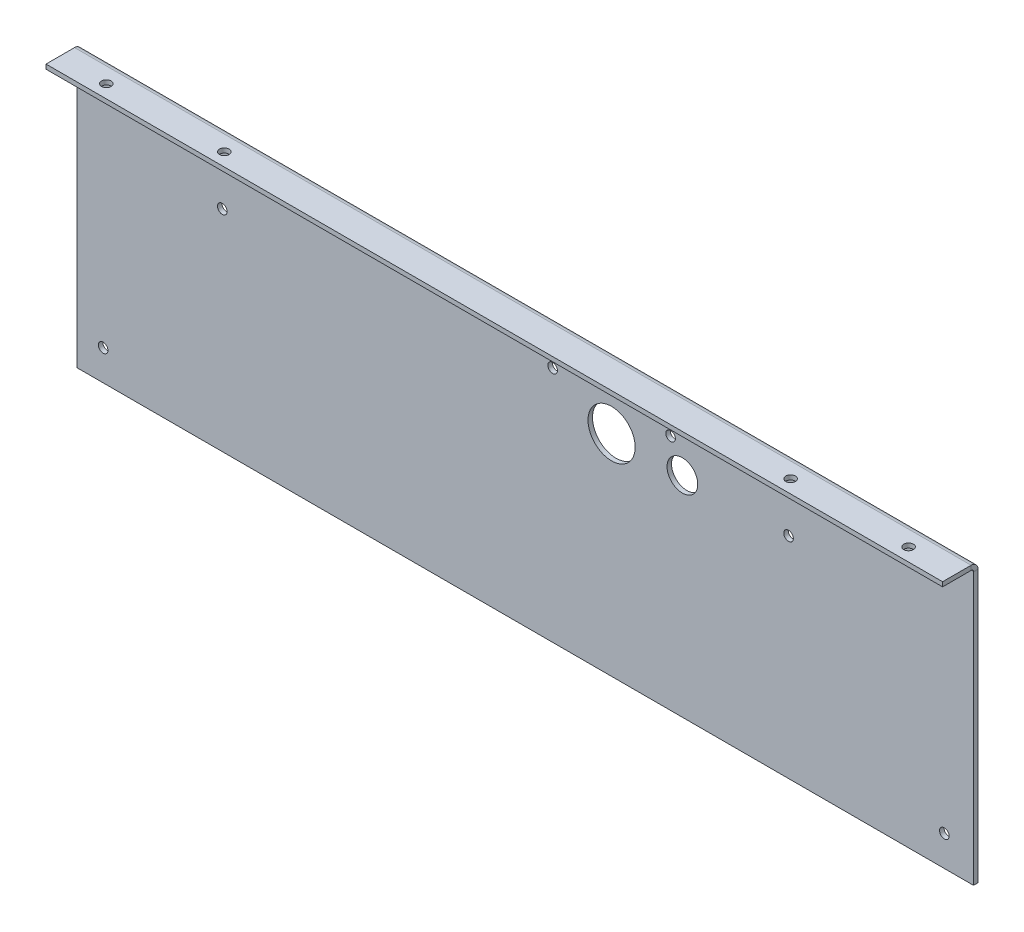
ISO-10303-21;
HEADER;
FILE_DESCRIPTION(('STEP AP214'),'2;1');
FILE_NAME('part.step','',(''),(''),'','','');
FILE_SCHEMA(('AUTOMOTIVE_DESIGN { 1 0 10303 214 1 1 1 1 }'));
ENDSEC;
DATA;
#1=APPLICATION_CONTEXT('core data for automotive mechanical design processes');
#2=APPLICATION_PROTOCOL_DEFINITION('international standard','automotive_design',2000,#1);
#3=PRODUCT_CONTEXT('',#1,'mechanical');
#4=PRODUCT('Part','Part','',(#3));
#5=PRODUCT_RELATED_PRODUCT_CATEGORY('part','',(#4));
#6=PRODUCT_DEFINITION_FORMATION('','',#4);
#7=PRODUCT_DEFINITION_CONTEXT('part definition',#1,'design');
#8=PRODUCT_DEFINITION('design','',#6,#7);
#9=PRODUCT_DEFINITION_SHAPE('','',#8);
#10=(LENGTH_UNIT() NAMED_UNIT(*) SI_UNIT(.MILLI.,.METRE.));
#11=(NAMED_UNIT(*) PLANE_ANGLE_UNIT() SI_UNIT($,.RADIAN.));
#12=(NAMED_UNIT(*) SI_UNIT($,.STERADIAN.) SOLID_ANGLE_UNIT());
#13=UNCERTAINTY_MEASURE_WITH_UNIT(LENGTH_MEASURE(1.E-05),#10,'distance_accuracy_value','');
#14=(GEOMETRIC_REPRESENTATION_CONTEXT(3) GLOBAL_UNCERTAINTY_ASSIGNED_CONTEXT((#13)) GLOBAL_UNIT_ASSIGNED_CONTEXT((#10,
#11,#12)) REPRESENTATION_CONTEXT('',''));
#15=CARTESIAN_POINT('',(0.,0.,0.));
#16=DIRECTION('',(0.,0.,1.));
#17=DIRECTION('',(1.,0.,0.));
#18=AXIS2_PLACEMENT_3D('',#15,#16,#17);
#19=CARTESIAN_POINT('',(-190.,59.,-1.9));
#20=DIRECTION('',(-1.,0.,0.));
#21=DIRECTION('',(0.,0.,1.));
#22=AXIS2_PLACEMENT_3D('',#19,#20,#21);
#23=PLANE('',#22);
#24=DIRECTION('',(0.,-1.,0.));
#25=VECTOR('',#24,1.);
#26=CARTESIAN_POINT('',(-190.,59.,0.));
#27=LINE('',#26,#25);
#28=CARTESIAN_POINT('',(-190.,56.1,0.));
#29=VERTEX_POINT('',#28);
#30=CARTESIAN_POINT('',(-190.,-59.,0.));
#31=VERTEX_POINT('',#30);
#32=EDGE_CURVE('E104',#29,#31,#27,.T.);
#33=ORIENTED_EDGE('',*,*,#32,.F.);
#34=DIRECTION('',(0.,0.,-1.));
#35=VECTOR('',#34,1.);
#36=CARTESIAN_POINT('',(-190.,56.1,0.));
#37=LINE('',#36,#35);
#38=CARTESIAN_POINT('',(-190.,56.1,-1.9));
#39=VERTEX_POINT('',#38);
#40=EDGE_CURVE('E214',#29,#39,#37,.T.);
#41=ORIENTED_EDGE('',*,*,#40,.T.);
#42=DIRECTION('',(0.,-1.,0.));
#43=VECTOR('',#42,1.);
#44=CARTESIAN_POINT('',(-190.,59.,-1.9));
#45=LINE('',#44,#43);
#46=CARTESIAN_POINT('',(-190.,-59.,-1.9));
#47=VERTEX_POINT('',#46);
#48=EDGE_CURVE('E110',#39,#47,#45,.T.);
#49=ORIENTED_EDGE('',*,*,#48,.T.);
#50=DIRECTION('',(0.,0.,1.));
#51=VECTOR('',#50,1.);
#52=CARTESIAN_POINT('',(-190.,-59.,-1.9));
#53=LINE('',#52,#51);
#54=EDGE_CURVE('E66',#47,#31,#53,.T.);
#55=ORIENTED_EDGE('',*,*,#54,.T.);
#56=EDGE_LOOP('',(#33,#41,#49,#55));
#57=FACE_BOUND('',#56,.T.);
#58=ADVANCED_FACE('F57',(#57),#23,.T.);
#59=CARTESIAN_POINT('',(0.,0.,-1.9));
#60=DIRECTION('',(0.,0.,1.));
#61=DIRECTION('',(1.,0.,0.));
#62=AXIS2_PLACEMENT_3D('',#59,#60,#61);
#63=PLANE('',#62);
#64=CARTESIAN_POINT('',(66.6106737677017,29.7737606004489,-1.9));
#65=DIRECTION('',(0.,0.,1.));
#66=DIRECTION('',(1.,0.,0.));
#67=AXIS2_PLACEMENT_3D('',#64,#65,#66);
#68=CIRCLE('',#67,6.5);
#69=CARTESIAN_POINT('',(73.1106737677018,29.7737606004489,-1.9));
#70=VERTEX_POINT('',#69);
#71=EDGE_CURVE('E597',#70,#70,#68,.T.);
#72=ORIENTED_EDGE('',*,*,#71,.T.);
#73=EDGE_LOOP('',(#72));
#74=FACE_BOUND('',#73,.T.);
#75=CARTESIAN_POINT('',(61.6106737677005,41.7355593553751,-1.9));
#76=DIRECTION('',(0.,0.,1.));
#77=DIRECTION('',(1.,0.,0.));
#78=AXIS2_PLACEMENT_3D('',#75,#76,#77);
#79=CIRCLE('',#78,2.04);
#80=CARTESIAN_POINT('',(63.6506737677005,41.7355593553751,-1.9));
#81=VERTEX_POINT('',#80);
#82=EDGE_CURVE('E599',#81,#81,#79,.T.);
#83=ORIENTED_EDGE('',*,*,#82,.T.);
#84=EDGE_LOOP('',(#83));
#85=FACE_BOUND('',#84,.T.);
#86=CARTESIAN_POINT('',(11.6106737677005,41.7355593553752,-1.9));
#87=DIRECTION('',(0.,0.,1.));
#88=DIRECTION('',(1.,0.,0.));
#89=AXIS2_PLACEMENT_3D('',#86,#87,#88);
#90=CIRCLE('',#89,2.04);
#91=CARTESIAN_POINT('',(13.6506737677005,41.7355593553752,-1.9));
#92=VERTEX_POINT('',#91);
#93=EDGE_CURVE('E605',#92,#92,#90,.T.);
#94=ORIENTED_EDGE('',*,*,#93,.T.);
#95=EDGE_LOOP('',(#94));
#96=FACE_BOUND('',#95,.T.);
#97=CARTESIAN_POINT('',(177.652523634122,-46.0999999999978,-1.9));
#98=DIRECTION('',(0.,0.,-1.));
#99=DIRECTION('',(-1.,0.,0.));
#100=AXIS2_PLACEMENT_3D('',#97,#98,#99);
#101=CIRCLE('',#100,2.04000000000001);
#102=CARTESIAN_POINT('',(175.612523634122,-46.0999999999978,-1.9));
#103=VERTEX_POINT('',#102);
#104=EDGE_CURVE('E128',#103,#103,#101,.T.);
#105=ORIENTED_EDGE('',*,*,#104,.F.);
#106=EDGE_LOOP('',(#105));
#107=FACE_BOUND('',#106,.T.);
#108=CARTESIAN_POINT('',(-178.889326232297,-46.0999999999975,-1.9));
#109=DIRECTION('',(0.,0.,-1.));
#110=DIRECTION('',(-1.,0.,0.));
#111=AXIS2_PLACEMENT_3D('',#108,#109,#110);
#112=CIRCLE('',#111,2.04000000000001);
#113=CARTESIAN_POINT('',(-180.929326232297,-46.0999999999975,-1.9));
#114=VERTEX_POINT('',#113);
#115=EDGE_CURVE('E117',#114,#114,#112,.T.);
#116=ORIENTED_EDGE('',*,*,#115,.F.);
#117=EDGE_LOOP('',(#116));
#118=FACE_BOUND('',#117,.T.);
#119=CARTESIAN_POINT('',(111.610673767702,30.1000000000001,-1.9));
#120=DIRECTION('',(0.,0.,1.));
#121=DIRECTION('',(1.,0.,0.));
#122=AXIS2_PLACEMENT_3D('',#119,#120,#121);
#123=CIRCLE('',#122,2.04);
#124=CARTESIAN_POINT('',(113.650673767702,30.1000000000001,-1.9));
#125=VERTEX_POINT('',#124);
#126=EDGE_CURVE('E155',#125,#125,#123,.T.);
#127=ORIENTED_EDGE('',*,*,#126,.T.);
#128=EDGE_LOOP('',(#127));
#129=FACE_BOUND('',#128,.T.);
#130=CARTESIAN_POINT('',(-128.389326232298,30.1000000000001,-1.9));
#131=DIRECTION('',(0.,0.,1.));
#132=DIRECTION('',(1.,0.,0.));
#133=AXIS2_PLACEMENT_3D('',#130,#131,#132);
#134=CIRCLE('',#133,2.03999999999998);
#135=CARTESIAN_POINT('',(-126.349326232298,30.1000000000001,-1.9));
#136=VERTEX_POINT('',#135);
#137=EDGE_CURVE('E161',#136,#136,#134,.T.);
#138=ORIENTED_EDGE('',*,*,#137,.T.);
#139=EDGE_LOOP('',(#138));
#140=FACE_BOUND('',#139,.T.);
#141=CARTESIAN_POINT('',(36.6106737677017,30.1000000000001,-1.9));
#142=DIRECTION('',(0.,0.,1.));
#143=DIRECTION('',(1.,0.,0.));
#144=AXIS2_PLACEMENT_3D('',#141,#142,#143);
#145=CIRCLE('',#144,10.);
#146=CARTESIAN_POINT('',(46.6106737677017,30.1000000000001,-1.9));
#147=VERTEX_POINT('',#146);
#148=EDGE_CURVE('E167',#147,#147,#145,.T.);
#149=ORIENTED_EDGE('',*,*,#148,.T.);
#150=EDGE_LOOP('',(#149));
#151=FACE_BOUND('',#150,.T.);
#152=DIRECTION('',(-1.,0.,0.));
#153=VECTOR('',#152,1.);
#154=CARTESIAN_POINT('',(-190.,56.1,-1.9));
#155=LINE('',#154,#153);
#156=CARTESIAN_POINT('',(190.,56.1,-1.9));
#157=VERTEX_POINT('',#156);
#158=EDGE_CURVE('E207',#39,#157,#155,.F.);
#159=ORIENTED_EDGE('',*,*,#158,.T.);
#160=DIRECTION('',(0.,1.,0.));
#161=VECTOR('',#160,1.);
#162=CARTESIAN_POINT('',(190.,59.,-1.9));
#163=LINE('',#162,#161);
#164=CARTESIAN_POINT('',(190.,-59.,-1.9));
#165=VERTEX_POINT('',#164);
#166=EDGE_CURVE('E108',#165,#157,#163,.T.);
#167=ORIENTED_EDGE('',*,*,#166,.F.);
#168=DIRECTION('',(1.,0.,0.));
#169=VECTOR('',#168,1.);
#170=CARTESIAN_POINT('',(-190.,-59.,-1.9));
#171=LINE('',#170,#169);
#172=EDGE_CURVE('E98',#47,#165,#171,.T.);
#173=ORIENTED_EDGE('',*,*,#172,.F.);
#174=ORIENTED_EDGE('',*,*,#48,.F.);
#175=EDGE_LOOP('',(#159,#167,#173,#174));
#176=FACE_BOUND('',#175,.T.);
#177=ADVANCED_FACE('F233',(#74,#85,#96,#107,#118,#129,#140,#151,#176),#63,.F.);
#178=CARTESIAN_POINT('',(0.,0.,0.));
#179=DIRECTION('',(0.,0.,1.));
#180=DIRECTION('',(1.,0.,0.));
#181=AXIS2_PLACEMENT_3D('',#178,#179,#180);
#182=PLANE('',#181);
#183=CARTESIAN_POINT('',(66.6106737677017,29.7737606004489,0.));
#184=DIRECTION('',(0.,0.,1.));
#185=DIRECTION('',(1.,0.,0.));
#186=AXIS2_PLACEMENT_3D('',#183,#184,#185);
#187=CIRCLE('',#186,6.5);
#188=CARTESIAN_POINT('',(73.1106737677018,29.7737606004489,0.));
#189=VERTEX_POINT('',#188);
#190=EDGE_CURVE('E308',#189,#189,#187,.T.);
#191=ORIENTED_EDGE('',*,*,#190,.F.);
#192=EDGE_LOOP('',(#191));
#193=FACE_BOUND('',#192,.T.);
#194=CARTESIAN_POINT('',(61.6106737677005,41.7355593553751,0.));
#195=DIRECTION('',(0.,0.,1.));
#196=DIRECTION('',(1.,0.,0.));
#197=AXIS2_PLACEMENT_3D('',#194,#195,#196);
#198=CIRCLE('',#197,2.04);
#199=CARTESIAN_POINT('',(63.6506737677005,41.7355593553751,0.));
#200=VERTEX_POINT('',#199);
#201=EDGE_CURVE('E312',#200,#200,#198,.T.);
#202=ORIENTED_EDGE('',*,*,#201,.F.);
#203=EDGE_LOOP('',(#202));
#204=FACE_BOUND('',#203,.T.);
#205=CARTESIAN_POINT('',(11.6106737677005,41.7355593553752,0.));
#206=DIRECTION('',(0.,0.,1.));
#207=DIRECTION('',(1.,0.,0.));
#208=AXIS2_PLACEMENT_3D('',#205,#206,#207);
#209=CIRCLE('',#208,2.04);
#210=CARTESIAN_POINT('',(13.6506737677005,41.7355593553752,0.));
#211=VERTEX_POINT('',#210);
#212=EDGE_CURVE('E316',#211,#211,#209,.T.);
#213=ORIENTED_EDGE('',*,*,#212,.F.);
#214=EDGE_LOOP('',(#213));
#215=FACE_BOUND('',#214,.T.);
#216=CARTESIAN_POINT('',(177.652523634122,-46.0999999999978,0.));
#217=DIRECTION('',(0.,0.,1.));
#218=DIRECTION('',(1.,0.,0.));
#219=AXIS2_PLACEMENT_3D('',#216,#217,#218);
#220=CIRCLE('',#219,2.04000000000001);
#221=CARTESIAN_POINT('',(179.692523634122,-46.0999999999978,0.));
#222=VERTEX_POINT('',#221);
#223=EDGE_CURVE('E61',#222,#222,#220,.T.);
#224=ORIENTED_EDGE('',*,*,#223,.F.);
#225=EDGE_LOOP('',(#224));
#226=FACE_BOUND('',#225,.T.);
#227=CARTESIAN_POINT('',(-178.889326232297,-46.0999999999975,0.));
#228=DIRECTION('',(0.,0.,1.));
#229=DIRECTION('',(1.,0.,0.));
#230=AXIS2_PLACEMENT_3D('',#227,#228,#229);
#231=CIRCLE('',#230,2.04000000000001);
#232=CARTESIAN_POINT('',(-176.849326232297,-46.0999999999975,0.));
#233=VERTEX_POINT('',#232);
#234=EDGE_CURVE('E114',#233,#233,#231,.T.);
#235=ORIENTED_EDGE('',*,*,#234,.F.);
#236=EDGE_LOOP('',(#235));
#237=FACE_BOUND('',#236,.T.);
#238=CARTESIAN_POINT('',(111.610673767702,30.1000000000001,0.));
#239=DIRECTION('',(0.,0.,1.));
#240=DIRECTION('',(1.,0.,0.));
#241=AXIS2_PLACEMENT_3D('',#238,#239,#240);
#242=CIRCLE('',#241,2.04);
#243=CARTESIAN_POINT('',(113.650673767702,30.1000000000001,0.));
#244=VERTEX_POINT('',#243);
#245=EDGE_CURVE('E152',#244,#244,#242,.T.);
#246=ORIENTED_EDGE('',*,*,#245,.F.);
#247=EDGE_LOOP('',(#246));
#248=FACE_BOUND('',#247,.T.);
#249=CARTESIAN_POINT('',(-128.389326232298,30.1000000000001,0.));
#250=DIRECTION('',(0.,0.,1.));
#251=DIRECTION('',(1.,0.,0.));
#252=AXIS2_PLACEMENT_3D('',#249,#250,#251);
#253=CIRCLE('',#252,2.03999999999998);
#254=CARTESIAN_POINT('',(-126.349326232298,30.1000000000001,0.));
#255=VERTEX_POINT('',#254);
#256=EDGE_CURVE('E158',#255,#255,#253,.T.);
#257=ORIENTED_EDGE('',*,*,#256,.F.);
#258=EDGE_LOOP('',(#257));
#259=FACE_BOUND('',#258,.T.);
#260=CARTESIAN_POINT('',(36.6106737677017,30.1000000000001,0.));
#261=DIRECTION('',(0.,0.,1.));
#262=DIRECTION('',(1.,0.,0.));
#263=AXIS2_PLACEMENT_3D('',#260,#261,#262);
#264=CIRCLE('',#263,10.);
#265=CARTESIAN_POINT('',(46.6106737677017,30.1000000000001,0.));
#266=VERTEX_POINT('',#265);
#267=EDGE_CURVE('E164',#266,#266,#264,.T.);
#268=ORIENTED_EDGE('',*,*,#267,.F.);
#269=EDGE_LOOP('',(#268));
#270=FACE_BOUND('',#269,.T.);
#271=DIRECTION('',(0.,1.,0.));
#272=VECTOR('',#271,1.);
#273=CARTESIAN_POINT('',(190.,59.,0.));
#274=LINE('',#273,#272);
#275=CARTESIAN_POINT('',(190.,-59.,0.));
#276=VERTEX_POINT('',#275);
#277=CARTESIAN_POINT('',(190.,56.1,0.));
#278=VERTEX_POINT('',#277);
#279=EDGE_CURVE('E100',#276,#278,#274,.T.);
#280=ORIENTED_EDGE('',*,*,#279,.T.);
#281=DIRECTION('',(-1.,0.,0.));
#282=VECTOR('',#281,1.);
#283=CARTESIAN_POINT('',(-190.,56.1,0.));
#284=LINE('',#283,#282);
#285=EDGE_CURVE('E74',#29,#278,#284,.F.);
#286=ORIENTED_EDGE('',*,*,#285,.F.);
#287=ORIENTED_EDGE('',*,*,#32,.T.);
#288=DIRECTION('',(1.,0.,0.));
#289=VECTOR('',#288,1.);
#290=CARTESIAN_POINT('',(-190.,-59.,0.));
#291=LINE('',#290,#289);
#292=EDGE_CURVE('E96',#31,#276,#291,.T.);
#293=ORIENTED_EDGE('',*,*,#292,.T.);
#294=EDGE_LOOP('',(#280,#286,#287,#293));
#295=FACE_BOUND('',#294,.T.);
#296=ADVANCED_FACE('F106',(#193,#204,#215,#226,#237,#248,#259,#270,#295),#182,.T.);
#297=CARTESIAN_POINT('',(190.,59.,-1.9));
#298=DIRECTION('',(1.,0.,0.));
#299=DIRECTION('',(0.,0.,-1.));
#300=AXIS2_PLACEMENT_3D('',#297,#298,#299);
#301=PLANE('',#300);
#302=DIRECTION('',(0.,0.,-1.));
#303=VECTOR('',#302,1.);
#304=CARTESIAN_POINT('',(190.,56.1,0.));
#305=LINE('',#304,#303);
#306=EDGE_CURVE('E103',#278,#157,#305,.T.);
#307=ORIENTED_EDGE('',*,*,#306,.F.);
#308=ORIENTED_EDGE('',*,*,#279,.F.);
#309=DIRECTION('',(0.,0.,1.));
#310=VECTOR('',#309,1.);
#311=CARTESIAN_POINT('',(190.,-59.,-1.9));
#312=LINE('',#311,#310);
#313=EDGE_CURVE('E13',#165,#276,#312,.T.);
#314=ORIENTED_EDGE('',*,*,#313,.F.);
#315=ORIENTED_EDGE('',*,*,#166,.T.);
#316=EDGE_LOOP('',(#307,#308,#314,#315));
#317=FACE_BOUND('',#316,.T.);
#318=ADVANCED_FACE('F59',(#317),#301,.T.);
#319=CARTESIAN_POINT('',(-190.,-59.,-1.9));
#320=DIRECTION('',(0.,-1.,0.));
#321=DIRECTION('',(0.,0.,-1.));
#322=AXIS2_PLACEMENT_3D('',#319,#320,#321);
#323=PLANE('',#322);
#324=ORIENTED_EDGE('',*,*,#292,.F.);
#325=ORIENTED_EDGE('',*,*,#54,.F.);
#326=ORIENTED_EDGE('',*,*,#172,.T.);
#327=ORIENTED_EDGE('',*,*,#313,.T.);
#328=EDGE_LOOP('',(#324,#325,#326,#327));
#329=FACE_BOUND('',#328,.T.);
#330=ADVANCED_FACE('F93',(#329),#323,.T.);
#331=CARTESIAN_POINT('',(190.,56.1,1.));
#332=DIRECTION('',(1.,0.,0.));
#333=DIRECTION('',(0.,0.,-1.));
#334=AXIS2_PLACEMENT_3D('',#331,#332,#333);
#335=PLANE('',#334);
#336=DIRECTION('',(0.,-1.,0.));
#337=VECTOR('',#336,1.);
#338=CARTESIAN_POINT('',(190.,59.,0.999999999999987));
#339=LINE('',#338,#337);
#340=CARTESIAN_POINT('',(190.,57.1,1.));
#341=VERTEX_POINT('',#340);
#342=CARTESIAN_POINT('',(190.,59.,0.999999999999994));
#343=VERTEX_POINT('',#342);
#344=EDGE_CURVE('E170',#341,#343,#339,.F.);
#345=ORIENTED_EDGE('',*,*,#344,.F.);
#346=CARTESIAN_POINT('',(190.,56.1,1.));
#347=DIRECTION('',(-1.,0.,0.));
#348=DIRECTION('',(0.,0.,1.));
#349=AXIS2_PLACEMENT_3D('',#346,#347,#348);
#350=CIRCLE('',#349,1.);
#351=EDGE_CURVE('E217',#278,#341,#350,.F.);
#352=ORIENTED_EDGE('',*,*,#351,.F.);
#353=ORIENTED_EDGE('',*,*,#306,.T.);
#354=CARTESIAN_POINT('',(190.,56.1,1.));
#355=DIRECTION('',(-1.,0.,0.));
#356=DIRECTION('',(0.,0.,1.));
#357=AXIS2_PLACEMENT_3D('',#354,#355,#356);
#358=CIRCLE('',#357,2.9);
#359=EDGE_CURVE('E210',#157,#343,#358,.F.);
#360=ORIENTED_EDGE('',*,*,#359,.T.);
#361=EDGE_LOOP('',(#345,#352,#353,#360));
#362=FACE_BOUND('',#361,.T.);
#363=ADVANCED_FACE('F238',(#362),#335,.T.);
#364=CARTESIAN_POINT('',(-190.,56.1,1.));
#365=DIRECTION('',(1.,0.,0.));
#366=DIRECTION('',(0.,0.,-1.));
#367=AXIS2_PLACEMENT_3D('',#364,#365,#366);
#368=PLANE('',#367);
#369=CARTESIAN_POINT('',(-190.,56.1,1.));
#370=DIRECTION('',(-1.,0.,0.));
#371=DIRECTION('',(0.,0.,1.));
#372=AXIS2_PLACEMENT_3D('',#369,#370,#371);
#373=CIRCLE('',#372,1.);
#374=CARTESIAN_POINT('',(-190.,57.1,1.));
#375=VERTEX_POINT('',#374);
#376=EDGE_CURVE('E174',#375,#29,#373,.T.);
#377=ORIENTED_EDGE('',*,*,#376,.F.);
#378=DIRECTION('',(0.,-1.,0.));
#379=VECTOR('',#378,1.);
#380=CARTESIAN_POINT('',(-190.,57.1,1.00000000000001));
#381=LINE('',#380,#379);
#382=CARTESIAN_POINT('',(-190.,59.,1.));
#383=VERTEX_POINT('',#382);
#384=EDGE_CURVE('E199',#375,#383,#381,.F.);
#385=ORIENTED_EDGE('',*,*,#384,.T.);
#386=CARTESIAN_POINT('',(-190.,56.1,1.));
#387=DIRECTION('',(-1.,0.,0.));
#388=DIRECTION('',(0.,0.,1.));
#389=AXIS2_PLACEMENT_3D('',#386,#387,#388);
#390=CIRCLE('',#389,2.9);
#391=EDGE_CURVE('E211',#383,#39,#390,.T.);
#392=ORIENTED_EDGE('',*,*,#391,.T.);
#393=ORIENTED_EDGE('',*,*,#40,.F.);
#394=EDGE_LOOP('',(#377,#385,#392,#393));
#395=FACE_BOUND('',#394,.T.);
#396=ADVANCED_FACE('F282',(#395),#368,.F.);
#397=CARTESIAN_POINT('',(-190.,56.1,1.));
#398=DIRECTION('',(-1.,0.,0.));
#399=DIRECTION('',(0.,1.,0.));
#400=AXIS2_PLACEMENT_3D('',#397,#398,#399);
#401=CYLINDRICAL_SURFACE('',#400,2.9);
#402=ORIENTED_EDGE('',*,*,#158,.F.);
#403=ORIENTED_EDGE('',*,*,#391,.F.);
#404=DIRECTION('',(-1.,0.,0.));
#405=VECTOR('',#404,1.);
#406=CARTESIAN_POINT('',(190.,59.,0.999999999999987));
#407=LINE('',#406,#405);
#408=EDGE_CURVE('E196',#383,#343,#407,.F.);
#409=ORIENTED_EDGE('',*,*,#408,.T.);
#410=ORIENTED_EDGE('',*,*,#359,.F.);
#411=EDGE_LOOP('',(#402,#403,#409,#410));
#412=FACE_BOUND('',#411,.T.);
#413=ADVANCED_FACE('F241',(#412),#401,.T.);
#414=CARTESIAN_POINT('',(-190.,56.1,1.));
#415=DIRECTION('',(-1.,0.,0.));
#416=DIRECTION('',(0.,1.,0.));
#417=AXIS2_PLACEMENT_3D('',#414,#415,#416);
#418=CYLINDRICAL_SURFACE('',#417,1.);
#419=ORIENTED_EDGE('',*,*,#285,.T.);
#420=ORIENTED_EDGE('',*,*,#351,.T.);
#421=DIRECTION('',(-1.,0.,0.));
#422=VECTOR('',#421,1.);
#423=CARTESIAN_POINT('',(190.,57.1,0.999999999999994));
#424=LINE('',#423,#422);
#425=EDGE_CURVE('E202',#341,#375,#424,.T.);
#426=ORIENTED_EDGE('',*,*,#425,.T.);
#427=ORIENTED_EDGE('',*,*,#376,.T.);
#428=EDGE_LOOP('',(#419,#420,#426,#427));
#429=FACE_BOUND('',#428,.T.);
#430=ADVANCED_FACE('F278',(#429),#418,.F.);
#431=CARTESIAN_POINT('',(190.,59.,0.));
#432=DIRECTION('',(-1.,0.,0.));
#433=DIRECTION('',(0.,0.,1.));
#434=AXIS2_PLACEMENT_3D('',#431,#432,#433);
#435=PLANE('',#434);
#436=ORIENTED_EDGE('',*,*,#344,.T.);
#437=DIRECTION('',(0.,0.,-1.));
#438=VECTOR('',#437,1.);
#439=CARTESIAN_POINT('',(190.,59.,-2.25394362812022E-13));
#440=LINE('',#439,#438);
#441=CARTESIAN_POINT('',(190.,59.,13.1));
#442=VERTEX_POINT('',#441);
#443=EDGE_CURVE('E184',#442,#343,#440,.T.);
#444=ORIENTED_EDGE('',*,*,#443,.F.);
#445=DIRECTION('',(0.,-1.,0.));
#446=VECTOR('',#445,1.);
#447=CARTESIAN_POINT('',(190.,59.,13.1));
#448=LINE('',#447,#446);
#449=CARTESIAN_POINT('',(190.,57.1000000000001,13.1));
#450=VERTEX_POINT('',#449);
#451=EDGE_CURVE('E175',#442,#450,#448,.T.);
#452=ORIENTED_EDGE('',*,*,#451,.T.);
#453=DIRECTION('',(0.,0.,1.));
#454=VECTOR('',#453,1.);
#455=CARTESIAN_POINT('',(190.,57.1,0.));
#456=LINE('',#455,#454);
#457=EDGE_CURVE('E193',#450,#341,#456,.F.);
#458=ORIENTED_EDGE('',*,*,#457,.T.);
#459=EDGE_LOOP('',(#436,#444,#452,#458));
#460=FACE_BOUND('',#459,.T.);
#461=ADVANCED_FACE('F352',(#460),#435,.F.);
#462=CARTESIAN_POINT('',(-190.,59.,13.1));
#463=DIRECTION('',(1.,0.,0.));
#464=DIRECTION('',(0.,0.,-1.));
#465=AXIS2_PLACEMENT_3D('',#462,#463,#464);
#466=PLANE('',#465);
#467=ORIENTED_EDGE('',*,*,#384,.F.);
#468=DIRECTION('',(0.,0.,-1.));
#469=VECTOR('',#468,1.);
#470=CARTESIAN_POINT('',(-190.,57.1000000000001,13.1));
#471=LINE('',#470,#469);
#472=CARTESIAN_POINT('',(-190.,57.1000000000001,13.1));
#473=VERTEX_POINT('',#472);
#474=EDGE_CURVE('E190',#375,#473,#471,.F.);
#475=ORIENTED_EDGE('',*,*,#474,.T.);
#476=DIRECTION('',(0.,-1.,0.));
#477=VECTOR('',#476,1.);
#478=CARTESIAN_POINT('',(-190.,59.,13.1));
#479=LINE('',#478,#477);
#480=CARTESIAN_POINT('',(-190.,59.,13.1));
#481=VERTEX_POINT('',#480);
#482=EDGE_CURVE('E171',#481,#473,#479,.T.);
#483=ORIENTED_EDGE('',*,*,#482,.F.);
#484=DIRECTION('',(0.,0.,1.));
#485=VECTOR('',#484,1.);
#486=CARTESIAN_POINT('',(-190.,59.,-2.25394362812022E-13));
#487=LINE('',#486,#485);
#488=EDGE_CURVE('E181',#383,#481,#487,.T.);
#489=ORIENTED_EDGE('',*,*,#488,.F.);
#490=EDGE_LOOP('',(#467,#475,#483,#489));
#491=FACE_BOUND('',#490,.T.);
#492=ADVANCED_FACE('F257',(#491),#466,.F.);
#493=CARTESIAN_POINT('',(0.,59.,-2.25394362812022E-13));
#494=DIRECTION('',(0.,-1.,0.));
#495=DIRECTION('',(0.,0.,-1.));
#496=AXIS2_PLACEMENT_3D('',#493,#494,#495);
#497=PLANE('',#496);
#498=CARTESIAN_POINT('',(120.,59.,7.52793999999998));
#499=DIRECTION('',(0.,-1.,0.));
#500=DIRECTION('',(0.,0.,-1.));
#501=AXIS2_PLACEMENT_3D('',#498,#499,#500);
#502=CIRCLE('',#501,2.03999999999998);
#503=CARTESIAN_POINT('',(120.,59.,5.48794));
#504=VERTEX_POINT('',#503);
#505=EDGE_CURVE('E121',#504,#504,#502,.T.);
#506=ORIENTED_EDGE('',*,*,#505,.T.);
#507=EDGE_LOOP('',(#506));
#508=FACE_BOUND('',#507,.T.);
#509=CARTESIAN_POINT('',(170.,59.,7.52793999999998));
#510=DIRECTION('',(0.,-1.,0.));
#511=DIRECTION('',(0.,0.,-1.));
#512=AXIS2_PLACEMENT_3D('',#509,#510,#511);
#513=CIRCLE('',#512,2.03999999999998);
#514=CARTESIAN_POINT('',(170.,59.,5.48794));
#515=VERTEX_POINT('',#514);
#516=EDGE_CURVE('E137',#515,#515,#513,.T.);
#517=ORIENTED_EDGE('',*,*,#516,.T.);
#518=EDGE_LOOP('',(#517));
#519=FACE_BOUND('',#518,.T.);
#520=CARTESIAN_POINT('',(-120.,59.,7.52793999999999));
#521=DIRECTION('',(0.,-1.,0.));
#522=DIRECTION('',(0.,0.,-1.));
#523=AXIS2_PLACEMENT_3D('',#520,#521,#522);
#524=CIRCLE('',#523,2.04);
#525=CARTESIAN_POINT('',(-120.,59.,5.48794));
#526=VERTEX_POINT('',#525);
#527=EDGE_CURVE('E143',#526,#526,#524,.T.);
#528=ORIENTED_EDGE('',*,*,#527,.T.);
#529=EDGE_LOOP('',(#528));
#530=FACE_BOUND('',#529,.T.);
#531=CARTESIAN_POINT('',(-170.,59.,7.52793999999999));
#532=DIRECTION('',(0.,-1.,0.));
#533=DIRECTION('',(0.,0.,-1.));
#534=AXIS2_PLACEMENT_3D('',#531,#532,#533);
#535=CIRCLE('',#534,2.03999999999998);
#536=CARTESIAN_POINT('',(-170.,59.,5.48794000000001));
#537=VERTEX_POINT('',#536);
#538=EDGE_CURVE('E149',#537,#537,#535,.T.);
#539=ORIENTED_EDGE('',*,*,#538,.T.);
#540=EDGE_LOOP('',(#539));
#541=FACE_BOUND('',#540,.T.);
#542=ORIENTED_EDGE('',*,*,#408,.F.);
#543=ORIENTED_EDGE('',*,*,#488,.T.);
#544=DIRECTION('',(1.,0.,0.));
#545=VECTOR('',#544,1.);
#546=CARTESIAN_POINT('',(0.,59.,13.1));
#547=LINE('',#546,#545);
#548=EDGE_CURVE('E178',#481,#442,#547,.T.);
#549=ORIENTED_EDGE('',*,*,#548,.T.);
#550=ORIENTED_EDGE('',*,*,#443,.T.);
#551=EDGE_LOOP('',(#542,#543,#549,#550));
#552=FACE_BOUND('',#551,.T.);
#553=ADVANCED_FACE('F249',(#508,#519,#530,#541,#552),#497,.F.);
#554=CARTESIAN_POINT('',(0.,57.1,-2.1876054826822E-13));
#555=DIRECTION('',(0.,-1.,0.));
#556=DIRECTION('',(0.,0.,-1.));
#557=AXIS2_PLACEMENT_3D('',#554,#555,#556);
#558=PLANE('',#557);
#559=CARTESIAN_POINT('',(120.,57.1,7.52793999999999));
#560=DIRECTION('',(0.,-1.,0.));
#561=DIRECTION('',(0.,0.,-1.));
#562=AXIS2_PLACEMENT_3D('',#559,#560,#561);
#563=CIRCLE('',#562,2.03999999999998);
#564=CARTESIAN_POINT('',(120.,57.1,5.48794000000001));
#565=VERTEX_POINT('',#564);
#566=EDGE_CURVE('E116',#565,#565,#563,.T.);
#567=ORIENTED_EDGE('',*,*,#566,.F.);
#568=EDGE_LOOP('',(#567));
#569=FACE_BOUND('',#568,.T.);
#570=CARTESIAN_POINT('',(170.,57.1,7.52793999999999));
#571=DIRECTION('',(0.,-1.,0.));
#572=DIRECTION('',(0.,0.,-1.));
#573=AXIS2_PLACEMENT_3D('',#570,#571,#572);
#574=CIRCLE('',#573,2.03999999999998);
#575=CARTESIAN_POINT('',(170.,57.1,5.48794000000001));
#576=VERTEX_POINT('',#575);
#577=EDGE_CURVE('E134',#576,#576,#574,.T.);
#578=ORIENTED_EDGE('',*,*,#577,.F.);
#579=EDGE_LOOP('',(#578));
#580=FACE_BOUND('',#579,.T.);
#581=CARTESIAN_POINT('',(-120.,57.1,7.52794));
#582=DIRECTION('',(0.,-1.,0.));
#583=DIRECTION('',(0.,0.,-1.));
#584=AXIS2_PLACEMENT_3D('',#581,#582,#583);
#585=CIRCLE('',#584,2.04);
#586=CARTESIAN_POINT('',(-120.,57.1,5.48794));
#587=VERTEX_POINT('',#586);
#588=EDGE_CURVE('E140',#587,#587,#585,.T.);
#589=ORIENTED_EDGE('',*,*,#588,.F.);
#590=EDGE_LOOP('',(#589));
#591=FACE_BOUND('',#590,.T.);
#592=CARTESIAN_POINT('',(-170.,57.1,7.52794));
#593=DIRECTION('',(0.,-1.,0.));
#594=DIRECTION('',(0.,0.,-1.));
#595=AXIS2_PLACEMENT_3D('',#592,#593,#594);
#596=CIRCLE('',#595,2.03999999999998);
#597=CARTESIAN_POINT('',(-170.,57.1,5.48794000000002));
#598=VERTEX_POINT('',#597);
#599=EDGE_CURVE('E146',#598,#598,#596,.T.);
#600=ORIENTED_EDGE('',*,*,#599,.F.);
#601=EDGE_LOOP('',(#600));
#602=FACE_BOUND('',#601,.T.);
#603=ORIENTED_EDGE('',*,*,#474,.F.);
#604=ORIENTED_EDGE('',*,*,#425,.F.);
#605=ORIENTED_EDGE('',*,*,#457,.F.);
#606=DIRECTION('',(-1.,0.,0.));
#607=VECTOR('',#606,1.);
#608=CARTESIAN_POINT('',(190.,57.1000000000001,13.1));
#609=LINE('',#608,#607);
#610=EDGE_CURVE('E187',#473,#450,#609,.F.);
#611=ORIENTED_EDGE('',*,*,#610,.F.);
#612=EDGE_LOOP('',(#603,#604,#605,#611));
#613=FACE_BOUND('',#612,.T.);
#614=ADVANCED_FACE('F340',(#569,#580,#591,#602,#613),#558,.T.);
#615=CARTESIAN_POINT('',(190.,59.,13.1));
#616=DIRECTION('',(0.,0.,-1.));
#617=DIRECTION('',(0.,1.,0.));
#618=AXIS2_PLACEMENT_3D('',#615,#616,#617);
#619=PLANE('',#618);
#620=ORIENTED_EDGE('',*,*,#610,.T.);
#621=ORIENTED_EDGE('',*,*,#451,.F.);
#622=ORIENTED_EDGE('',*,*,#548,.F.);
#623=ORIENTED_EDGE('',*,*,#482,.T.);
#624=EDGE_LOOP('',(#620,#621,#622,#623));
#625=FACE_BOUND('',#624,.T.);
#626=ADVANCED_FACE('F266',(#625),#619,.F.);
#627=CARTESIAN_POINT('',(36.6106737677017,30.1000000000001,-10.));
#628=DIRECTION('',(0.,0.,1.));
#629=DIRECTION('',(1.,0.,0.));
#630=AXIS2_PLACEMENT_3D('',#627,#628,#629);
#631=CYLINDRICAL_SURFACE('',#630,10.);
#632=ORIENTED_EDGE('',*,*,#267,.T.);
#633=EDGE_LOOP('',(#632));
#634=FACE_BOUND('',#633,.T.);
#635=ORIENTED_EDGE('',*,*,#148,.F.);
#636=EDGE_LOOP('',(#635));
#637=FACE_BOUND('',#636,.T.);
#638=ADVANCED_FACE('F326',(#634,#637),#631,.F.);
#639=CARTESIAN_POINT('',(-128.389326232298,30.1000000000001,-10.));
#640=DIRECTION('',(0.,0.,1.));
#641=DIRECTION('',(1.,0.,0.));
#642=AXIS2_PLACEMENT_3D('',#639,#640,#641);
#643=CYLINDRICAL_SURFACE('',#642,2.03999999999998);
#644=ORIENTED_EDGE('',*,*,#256,.T.);
#645=EDGE_LOOP('',(#644));
#646=FACE_BOUND('',#645,.T.);
#647=ORIENTED_EDGE('',*,*,#137,.F.);
#648=EDGE_LOOP('',(#647));
#649=FACE_BOUND('',#648,.T.);
#650=ADVANCED_FACE('F329',(#646,#649),#643,.F.);
#651=CARTESIAN_POINT('',(111.610673767702,30.1000000000001,-10.));
#652=DIRECTION('',(0.,0.,1.));
#653=DIRECTION('',(1.,0.,0.));
#654=AXIS2_PLACEMENT_3D('',#651,#652,#653);
#655=CYLINDRICAL_SURFACE('',#654,2.04);
#656=ORIENTED_EDGE('',*,*,#245,.T.);
#657=EDGE_LOOP('',(#656));
#658=FACE_BOUND('',#657,.T.);
#659=ORIENTED_EDGE('',*,*,#126,.F.);
#660=EDGE_LOOP('',(#659));
#661=FACE_BOUND('',#660,.T.);
#662=ADVANCED_FACE('F337',(#658,#661),#655,.F.);
#663=CARTESIAN_POINT('',(-170.,67.1,7.52793999999997));
#664=DIRECTION('',(0.,-1.,0.));
#665=DIRECTION('',(0.,0.,-1.));
#666=AXIS2_PLACEMENT_3D('',#663,#664,#665);
#667=CYLINDRICAL_SURFACE('',#666,2.03999999999998);
#668=ORIENTED_EDGE('',*,*,#599,.T.);
#669=EDGE_LOOP('',(#668));
#670=FACE_BOUND('',#669,.T.);
#671=ORIENTED_EDGE('',*,*,#538,.F.);
#672=EDGE_LOOP('',(#671));
#673=FACE_BOUND('',#672,.T.);
#674=ADVANCED_FACE('F403',(#670,#673),#667,.F.);
#675=CARTESIAN_POINT('',(-120.,67.1,7.52793999999997));
#676=DIRECTION('',(0.,-1.,0.));
#677=DIRECTION('',(0.,0.,-1.));
#678=AXIS2_PLACEMENT_3D('',#675,#676,#677);
#679=CYLINDRICAL_SURFACE('',#678,2.04);
#680=ORIENTED_EDGE('',*,*,#588,.T.);
#681=EDGE_LOOP('',(#680));
#682=FACE_BOUND('',#681,.T.);
#683=ORIENTED_EDGE('',*,*,#527,.F.);
#684=EDGE_LOOP('',(#683));
#685=FACE_BOUND('',#684,.T.);
#686=ADVANCED_FACE('F413',(#682,#685),#679,.F.);
#687=CARTESIAN_POINT('',(170.,67.1,7.52793999999995));
#688=DIRECTION('',(0.,-1.,0.));
#689=DIRECTION('',(0.,0.,-1.));
#690=AXIS2_PLACEMENT_3D('',#687,#688,#689);
#691=CYLINDRICAL_SURFACE('',#690,2.03999999999998);
#692=ORIENTED_EDGE('',*,*,#577,.T.);
#693=EDGE_LOOP('',(#692));
#694=FACE_BOUND('',#693,.T.);
#695=ORIENTED_EDGE('',*,*,#516,.F.);
#696=EDGE_LOOP('',(#695));
#697=FACE_BOUND('',#696,.T.);
#698=ADVANCED_FACE('F420',(#694,#697),#691,.F.);
#699=CARTESIAN_POINT('',(120.,67.1,7.52793999999995));
#700=DIRECTION('',(0.,-1.,0.));
#701=DIRECTION('',(0.,0.,-1.));
#702=AXIS2_PLACEMENT_3D('',#699,#700,#701);
#703=CYLINDRICAL_SURFACE('',#702,2.03999999999998);
#704=ORIENTED_EDGE('',*,*,#566,.T.);
#705=EDGE_LOOP('',(#704));
#706=FACE_BOUND('',#705,.T.);
#707=ORIENTED_EDGE('',*,*,#505,.F.);
#708=EDGE_LOOP('',(#707));
#709=FACE_BOUND('',#708,.T.);
#710=ADVANCED_FACE('F428',(#706,#709),#703,.F.);
#711=CARTESIAN_POINT('',(-178.889326232297,-46.0999999999975,8.1));
#712=DIRECTION('',(0.,0.,-1.));
#713=DIRECTION('',(-1.,0.,0.));
#714=AXIS2_PLACEMENT_3D('',#711,#712,#713);
#715=CYLINDRICAL_SURFACE('',#714,2.04000000000001);
#716=ORIENTED_EDGE('',*,*,#234,.T.);
#717=EDGE_LOOP('',(#716));
#718=FACE_BOUND('',#717,.T.);
#719=ORIENTED_EDGE('',*,*,#115,.T.);
#720=EDGE_LOOP('',(#719));
#721=FACE_BOUND('',#720,.T.);
#722=ADVANCED_FACE('F436',(#718,#721),#715,.F.);
#723=CARTESIAN_POINT('',(177.652523634122,-46.0999999999978,8.1));
#724=DIRECTION('',(0.,0.,-1.));
#725=DIRECTION('',(-1.,0.,0.));
#726=AXIS2_PLACEMENT_3D('',#723,#724,#725);
#727=CYLINDRICAL_SURFACE('',#726,2.04000000000001);
#728=ORIENTED_EDGE('',*,*,#223,.T.);
#729=EDGE_LOOP('',(#728));
#730=FACE_BOUND('',#729,.T.);
#731=ORIENTED_EDGE('',*,*,#104,.T.);
#732=EDGE_LOOP('',(#731));
#733=FACE_BOUND('',#732,.T.);
#734=ADVANCED_FACE('F444',(#730,#733),#727,.F.);
#735=CARTESIAN_POINT('',(11.6106737677005,41.7355593553752,-10.));
#736=DIRECTION('',(0.,0.,1.));
#737=DIRECTION('',(1.,0.,0.));
#738=AXIS2_PLACEMENT_3D('',#735,#736,#737);
#739=CYLINDRICAL_SURFACE('',#738,2.04);
#740=ORIENTED_EDGE('',*,*,#212,.T.);
#741=EDGE_LOOP('',(#740));
#742=FACE_BOUND('',#741,.T.);
#743=ORIENTED_EDGE('',*,*,#93,.F.);
#744=EDGE_LOOP('',(#743));
#745=FACE_BOUND('',#744,.T.);
#746=ADVANCED_FACE('F451',(#742,#745),#739,.F.);
#747=CARTESIAN_POINT('',(61.6106737677005,41.7355593553751,-10.));
#748=DIRECTION('',(0.,0.,1.));
#749=DIRECTION('',(1.,0.,0.));
#750=AXIS2_PLACEMENT_3D('',#747,#748,#749);
#751=CYLINDRICAL_SURFACE('',#750,2.04);
#752=ORIENTED_EDGE('',*,*,#201,.T.);
#753=EDGE_LOOP('',(#752));
#754=FACE_BOUND('',#753,.T.);
#755=ORIENTED_EDGE('',*,*,#82,.F.);
#756=EDGE_LOOP('',(#755));
#757=FACE_BOUND('',#756,.T.);
#758=ADVANCED_FACE('F459',(#754,#757),#751,.F.);
#759=CARTESIAN_POINT('',(66.6106737677017,29.7737606004489,-62.));
#760=DIRECTION('',(0.,0.,1.));
#761=DIRECTION('',(1.,0.,0.));
#762=AXIS2_PLACEMENT_3D('',#759,#760,#761);
#763=CYLINDRICAL_SURFACE('',#762,6.5);
#764=ORIENTED_EDGE('',*,*,#190,.T.);
#765=EDGE_LOOP('',(#764));
#766=FACE_BOUND('',#765,.T.);
#767=ORIENTED_EDGE('',*,*,#71,.F.);
#768=EDGE_LOOP('',(#767));
#769=FACE_BOUND('',#768,.T.);
#770=ADVANCED_FACE('F467',(#766,#769),#763,.F.);
#771=CLOSED_SHELL('',(#58,#177,#296,#318,#330,#363,#396,#413,#430,#461,#492,#553,#614,#626,#638,
#650,#662,#674,#686,#698,#710,#722,#734,#746,#758,#770));
#772=MANIFOLD_SOLID_BREP('B2',#771);
#773=ADVANCED_BREP_SHAPE_REPRESENTATION('',(#18,#772),#14);
#774=SHAPE_DEFINITION_REPRESENTATION(#9,#773);
ENDSEC;
END-ISO-10303-21;
